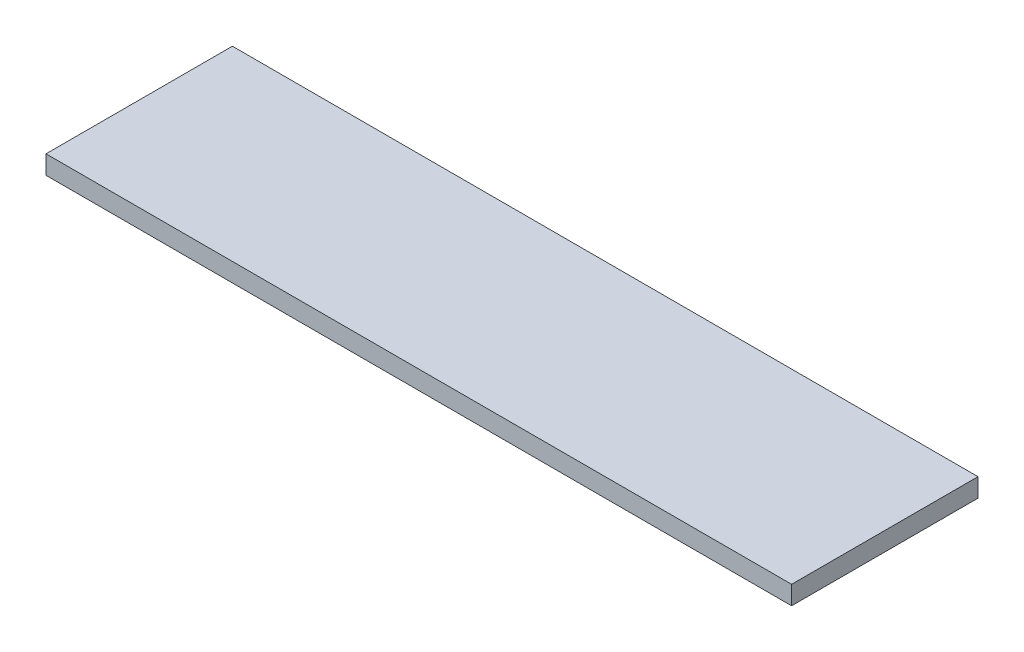
ISO-10303-21;
HEADER;
FILE_DESCRIPTION(('STEP AP214'),'2;1');
FILE_NAME('part.step','',(''),(''),'','','');
FILE_SCHEMA(('AUTOMOTIVE_DESIGN { 1 0 10303 214 1 1 1 1 }'));
ENDSEC;
DATA;
#1=APPLICATION_CONTEXT('core data for automotive mechanical design processes');
#2=APPLICATION_PROTOCOL_DEFINITION('international standard','automotive_design',2000,#1);
#3=PRODUCT_CONTEXT('',#1,'mechanical');
#4=PRODUCT('Part','Part','',(#3));
#5=PRODUCT_RELATED_PRODUCT_CATEGORY('part','',(#4));
#6=PRODUCT_DEFINITION_FORMATION('','',#4);
#7=PRODUCT_DEFINITION_CONTEXT('part definition',#1,'design');
#8=PRODUCT_DEFINITION('design','',#6,#7);
#9=PRODUCT_DEFINITION_SHAPE('','',#8);
#10=(LENGTH_UNIT() NAMED_UNIT(*) SI_UNIT(.MILLI.,.METRE.));
#11=(NAMED_UNIT(*) PLANE_ANGLE_UNIT() SI_UNIT($,.RADIAN.));
#12=(NAMED_UNIT(*) SI_UNIT($,.STERADIAN.) SOLID_ANGLE_UNIT());
#13=UNCERTAINTY_MEASURE_WITH_UNIT(LENGTH_MEASURE(1.E-05),#10,'distance_accuracy_value','');
#14=(GEOMETRIC_REPRESENTATION_CONTEXT(3) GLOBAL_UNCERTAINTY_ASSIGNED_CONTEXT((#13)) GLOBAL_UNIT_ASSIGNED_CONTEXT((#10,
#11,#12)) REPRESENTATION_CONTEXT('',''));
#15=CARTESIAN_POINT('',(0.,0.,0.));
#16=DIRECTION('',(0.,0.,1.));
#17=DIRECTION('',(1.,0.,0.));
#18=AXIS2_PLACEMENT_3D('',#15,#16,#17);
#19=CARTESIAN_POINT('',(-200.,10.,-50.));
#20=DIRECTION('',(1.,0.,0.));
#21=DIRECTION('',(0.,0.,-1.));
#22=AXIS2_PLACEMENT_3D('',#19,#20,#21);
#23=PLANE('',#22);
#24=DIRECTION('',(0.,0.,1.));
#25=VECTOR('',#24,1.);
#26=CARTESIAN_POINT('',(-200.,0.,-50.));
#27=LINE('',#26,#25);
#28=CARTESIAN_POINT('',(-200.,0.,-50.));
#29=VERTEX_POINT('',#28);
#30=CARTESIAN_POINT('',(-200.,0.,50.));
#31=VERTEX_POINT('',#30);
#32=EDGE_CURVE('E97',#29,#31,#27,.T.);
#33=ORIENTED_EDGE('',*,*,#32,.T.);
#34=DIRECTION('',(0.,-1.,0.));
#35=VECTOR('',#34,1.);
#36=CARTESIAN_POINT('',(-200.,10.,50.));
#37=LINE('',#36,#35);
#38=CARTESIAN_POINT('',(-200.,10.,50.));
#39=VERTEX_POINT('',#38);
#40=EDGE_CURVE('E11',#39,#31,#37,.T.);
#41=ORIENTED_EDGE('',*,*,#40,.F.);
#42=DIRECTION('',(0.,0.,1.));
#43=VECTOR('',#42,1.);
#44=CARTESIAN_POINT('',(-200.,10.,-50.));
#45=LINE('',#44,#43);
#46=CARTESIAN_POINT('',(-200.,10.,-50.));
#47=VERTEX_POINT('',#46);
#48=EDGE_CURVE('E85',#47,#39,#45,.T.);
#49=ORIENTED_EDGE('',*,*,#48,.F.);
#50=DIRECTION('',(0.,-1.,0.));
#51=VECTOR('',#50,1.);
#52=CARTESIAN_POINT('',(-200.,10.,-50.));
#53=LINE('',#52,#51);
#54=EDGE_CURVE('E93',#47,#29,#53,.T.);
#55=ORIENTED_EDGE('',*,*,#54,.T.);
#56=EDGE_LOOP('',(#33,#41,#49,#55));
#57=FACE_BOUND('',#56,.T.);
#58=ADVANCED_FACE('F34',(#57),#23,.F.);
#59=CARTESIAN_POINT('',(-200.,10.,50.));
#60=DIRECTION('',(0.,0.,-1.));
#61=DIRECTION('',(-1.,0.,0.));
#62=AXIS2_PLACEMENT_3D('',#59,#60,#61);
#63=PLANE('',#62);
#64=DIRECTION('',(1.,0.,0.));
#65=VECTOR('',#64,1.);
#66=CARTESIAN_POINT('',(-200.,0.,50.));
#67=LINE('',#66,#65);
#68=CARTESIAN_POINT('',(200.,0.,50.));
#69=VERTEX_POINT('',#68);
#70=EDGE_CURVE('E89',#31,#69,#67,.T.);
#71=ORIENTED_EDGE('',*,*,#70,.T.);
#72=DIRECTION('',(0.,-1.,0.));
#73=VECTOR('',#72,1.);
#74=CARTESIAN_POINT('',(200.,10.,50.));
#75=LINE('',#74,#73);
#76=CARTESIAN_POINT('',(200.,10.,50.));
#77=VERTEX_POINT('',#76);
#78=EDGE_CURVE('E42',#77,#69,#75,.T.);
#79=ORIENTED_EDGE('',*,*,#78,.F.);
#80=DIRECTION('',(1.,0.,0.));
#81=VECTOR('',#80,1.);
#82=CARTESIAN_POINT('',(-200.,10.,50.));
#83=LINE('',#82,#81);
#84=EDGE_CURVE('E80',#39,#77,#83,.T.);
#85=ORIENTED_EDGE('',*,*,#84,.F.);
#86=ORIENTED_EDGE('',*,*,#40,.T.);
#87=EDGE_LOOP('',(#71,#79,#85,#86));
#88=FACE_BOUND('',#87,.T.);
#89=ADVANCED_FACE('F88',(#88),#63,.F.);
#90=CARTESIAN_POINT('',(200.,10.,-50.));
#91=DIRECTION('',(-1.,0.,0.));
#92=DIRECTION('',(0.,0.,1.));
#93=AXIS2_PLACEMENT_3D('',#90,#91,#92);
#94=PLANE('',#93);
#95=DIRECTION('',(0.,0.,-1.));
#96=VECTOR('',#95,1.);
#97=CARTESIAN_POINT('',(200.,0.,-50.));
#98=LINE('',#97,#96);
#99=CARTESIAN_POINT('',(200.,0.,-50.));
#100=VERTEX_POINT('',#99);
#101=EDGE_CURVE('E67',#69,#100,#98,.T.);
#102=ORIENTED_EDGE('',*,*,#101,.T.);
#103=DIRECTION('',(0.,-1.,0.));
#104=VECTOR('',#103,1.);
#105=CARTESIAN_POINT('',(200.,10.,-50.));
#106=LINE('',#105,#104);
#107=CARTESIAN_POINT('',(200.,10.,-50.));
#108=VERTEX_POINT('',#107);
#109=EDGE_CURVE('E90',#108,#100,#106,.T.);
#110=ORIENTED_EDGE('',*,*,#109,.F.);
#111=DIRECTION('',(0.,0.,-1.));
#112=VECTOR('',#111,1.);
#113=CARTESIAN_POINT('',(200.,10.,-50.));
#114=LINE('',#113,#112);
#115=EDGE_CURVE('E83',#77,#108,#114,.T.);
#116=ORIENTED_EDGE('',*,*,#115,.F.);
#117=ORIENTED_EDGE('',*,*,#78,.T.);
#118=EDGE_LOOP('',(#102,#110,#116,#117));
#119=FACE_BOUND('',#118,.T.);
#120=ADVANCED_FACE('F91',(#119),#94,.F.);
#121=CARTESIAN_POINT('',(-200.,10.,-50.));
#122=DIRECTION('',(0.,0.,1.));
#123=DIRECTION('',(1.,0.,0.));
#124=AXIS2_PLACEMENT_3D('',#121,#122,#123);
#125=PLANE('',#124);
#126=DIRECTION('',(-1.,0.,0.));
#127=VECTOR('',#126,1.);
#128=CARTESIAN_POINT('',(-200.,0.,-50.));
#129=LINE('',#128,#127);
#130=EDGE_CURVE('E73',#100,#29,#129,.T.);
#131=ORIENTED_EDGE('',*,*,#130,.T.);
#132=ORIENTED_EDGE('',*,*,#54,.F.);
#133=DIRECTION('',(-1.,0.,0.));
#134=VECTOR('',#133,1.);
#135=CARTESIAN_POINT('',(-200.,10.,-50.));
#136=LINE('',#135,#134);
#137=EDGE_CURVE('E50',#108,#47,#136,.T.);
#138=ORIENTED_EDGE('',*,*,#137,.F.);
#139=ORIENTED_EDGE('',*,*,#109,.T.);
#140=EDGE_LOOP('',(#131,#132,#138,#139));
#141=FACE_BOUND('',#140,.T.);
#142=ADVANCED_FACE('F104',(#141),#125,.F.);
#143=CARTESIAN_POINT('',(0.,10.,0.));
#144=DIRECTION('',(0.,1.,0.));
#145=DIRECTION('',(0.,0.,1.));
#146=AXIS2_PLACEMENT_3D('',#143,#144,#145);
#147=PLANE('',#146);
#148=ORIENTED_EDGE('',*,*,#48,.T.);
#149=ORIENTED_EDGE('',*,*,#84,.T.);
#150=ORIENTED_EDGE('',*,*,#115,.T.);
#151=ORIENTED_EDGE('',*,*,#137,.T.);
#152=EDGE_LOOP('',(#148,#149,#150,#151));
#153=FACE_BOUND('',#152,.T.);
#154=ADVANCED_FACE('F81',(#153),#147,.T.);
#155=CARTESIAN_POINT('',(0.,0.,0.));
#156=DIRECTION('',(0.,1.,0.));
#157=DIRECTION('',(0.,0.,1.));
#158=AXIS2_PLACEMENT_3D('',#155,#156,#157);
#159=PLANE('',#158);
#160=ORIENTED_EDGE('',*,*,#32,.F.);
#161=ORIENTED_EDGE('',*,*,#130,.F.);
#162=ORIENTED_EDGE('',*,*,#101,.F.);
#163=ORIENTED_EDGE('',*,*,#70,.F.);
#164=EDGE_LOOP('',(#160,#161,#162,#163));
#165=FACE_BOUND('',#164,.T.);
#166=ADVANCED_FACE('F107',(#165),#159,.F.);
#167=CLOSED_SHELL('',(#58,#89,#120,#142,#154,#166));
#168=MANIFOLD_SOLID_BREP('B2',#167);
#169=ADVANCED_BREP_SHAPE_REPRESENTATION('',(#18,#168),#14);
#170=SHAPE_DEFINITION_REPRESENTATION(#9,#169);
ENDSEC;
END-ISO-10303-21;
